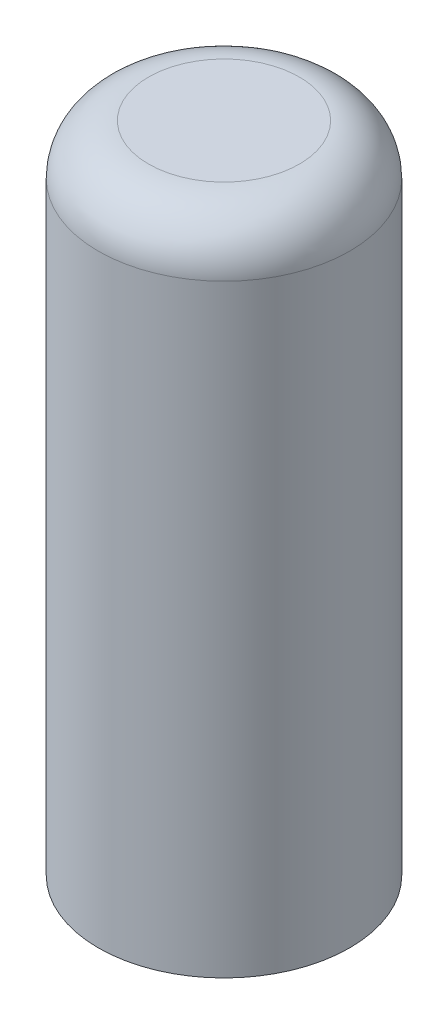
ISO-10303-21;
HEADER;
FILE_DESCRIPTION(('STEP AP214'),'2;1');
FILE_NAME('part.step','',(''),(''),'','','');
FILE_SCHEMA(('AUTOMOTIVE_DESIGN { 1 0 10303 214 1 1 1 1 }'));
ENDSEC;
DATA;
#1=APPLICATION_CONTEXT('core data for automotive mechanical design processes');
#2=APPLICATION_PROTOCOL_DEFINITION('international standard','automotive_design',2000,#1);
#3=PRODUCT_CONTEXT('',#1,'mechanical');
#4=PRODUCT('Part','Part','',(#3));
#5=PRODUCT_RELATED_PRODUCT_CATEGORY('part','',(#4));
#6=PRODUCT_DEFINITION_FORMATION('','',#4);
#7=PRODUCT_DEFINITION_CONTEXT('part definition',#1,'design');
#8=PRODUCT_DEFINITION('design','',#6,#7);
#9=PRODUCT_DEFINITION_SHAPE('','',#8);
#10=(LENGTH_UNIT() NAMED_UNIT(*) SI_UNIT(.MILLI.,.METRE.));
#11=(NAMED_UNIT(*) PLANE_ANGLE_UNIT() SI_UNIT($,.RADIAN.));
#12=(NAMED_UNIT(*) SI_UNIT($,.STERADIAN.) SOLID_ANGLE_UNIT());
#13=UNCERTAINTY_MEASURE_WITH_UNIT(LENGTH_MEASURE(1.E-05),#10,'distance_accuracy_value','');
#14=(GEOMETRIC_REPRESENTATION_CONTEXT(3) GLOBAL_UNCERTAINTY_ASSIGNED_CONTEXT((#13)) GLOBAL_UNIT_ASSIGNED_CONTEXT((#10,
#11,#12)) REPRESENTATION_CONTEXT('',''));
#15=CARTESIAN_POINT('',(0.,0.,0.));
#16=DIRECTION('',(0.,0.,1.));
#17=DIRECTION('',(1.,0.,0.));
#18=AXIS2_PLACEMENT_3D('',#15,#16,#17);
#19=CARTESIAN_POINT('',(0.575,6.5,-0.6));
#20=DIRECTION('',(-1.,0.,0.));
#21=DIRECTION('',(0.,0.,1.));
#22=AXIS2_PLACEMENT_3D('',#19,#20,#21);
#23=PLANE('',#22);
#24=DIRECTION('',(0.,-1.,0.));
#25=VECTOR('',#24,1.);
#26=CARTESIAN_POINT('',(0.575,6.5,0.6));
#27=LINE('',#26,#25);
#28=CARTESIAN_POINT('',(0.575,5.5,0.6));
#29=VERTEX_POINT('',#28);
#30=CARTESIAN_POINT('',(0.575,-6.5,0.6));
#31=VERTEX_POINT('',#30);
#32=EDGE_CURVE('E63',#29,#31,#27,.T.);
#33=ORIENTED_EDGE('',*,*,#32,.F.);
#34=DIRECTION('',(0.,0.,-1.));
#35=VECTOR('',#34,1.);
#36=CARTESIAN_POINT('',(0.575,5.5,0.6));
#37=LINE('',#36,#35);
#38=CARTESIAN_POINT('',(0.575,5.5,-0.6));
#39=VERTEX_POINT('',#38);
#40=EDGE_CURVE('E56',#29,#39,#37,.T.);
#41=ORIENTED_EDGE('',*,*,#40,.T.);
#42=DIRECTION('',(0.,-1.,0.));
#43=VECTOR('',#42,1.);
#44=CARTESIAN_POINT('',(0.575,6.5,-0.6));
#45=LINE('',#44,#43);
#46=CARTESIAN_POINT('',(0.575,-6.5,-0.6));
#47=VERTEX_POINT('',#46);
#48=EDGE_CURVE('E90',#39,#47,#45,.T.);
#49=ORIENTED_EDGE('',*,*,#48,.T.);
#50=DIRECTION('',(0.,0.,-1.));
#51=VECTOR('',#50,1.);
#52=CARTESIAN_POINT('',(0.575,-6.5,-0.6));
#53=LINE('',#52,#51);
#54=EDGE_CURVE('E141',#31,#47,#53,.T.);
#55=ORIENTED_EDGE('',*,*,#54,.F.);
#56=EDGE_LOOP('',(#33,#41,#49,#55));
#57=FACE_BOUND('',#56,.T.);
#58=ADVANCED_FACE('F41',(#57),#23,.T.);
#59=CARTESIAN_POINT('',(-0.575,6.5,-0.6));
#60=DIRECTION('',(0.,0.,1.));
#61=DIRECTION('',(1.,0.,0.));
#62=AXIS2_PLACEMENT_3D('',#59,#60,#61);
#63=PLANE('',#62);
#64=ORIENTED_EDGE('',*,*,#48,.F.);
#65=DIRECTION('',(-1.,0.,0.));
#66=VECTOR('',#65,1.);
#67=CARTESIAN_POINT('',(0.575,5.5,-0.6));
#68=LINE('',#67,#66);
#69=CARTESIAN_POINT('',(-0.575,5.5,-0.6));
#70=VERTEX_POINT('',#69);
#71=EDGE_CURVE('E81',#39,#70,#68,.T.);
#72=ORIENTED_EDGE('',*,*,#71,.T.);
#73=DIRECTION('',(0.,-1.,0.));
#74=VECTOR('',#73,1.);
#75=CARTESIAN_POINT('',(-0.575,6.5,-0.6));
#76=LINE('',#75,#74);
#77=CARTESIAN_POINT('',(-0.575,-6.5,-0.6));
#78=VERTEX_POINT('',#77);
#79=EDGE_CURVE('E99',#70,#78,#76,.T.);
#80=ORIENTED_EDGE('',*,*,#79,.T.);
#81=DIRECTION('',(-1.,0.,0.));
#82=VECTOR('',#81,1.);
#83=CARTESIAN_POINT('',(-0.575,-6.5,-0.6));
#84=LINE('',#83,#82);
#85=EDGE_CURVE('E96',#47,#78,#84,.T.);
#86=ORIENTED_EDGE('',*,*,#85,.F.);
#87=EDGE_LOOP('',(#64,#72,#80,#86));
#88=FACE_BOUND('',#87,.T.);
#89=ADVANCED_FACE('F94',(#88),#63,.T.);
#90=CARTESIAN_POINT('',(-0.575,6.5,-0.6));
#91=DIRECTION('',(1.,0.,0.));
#92=DIRECTION('',(0.,0.,-1.));
#93=AXIS2_PLACEMENT_3D('',#90,#91,#92);
#94=PLANE('',#93);
#95=ORIENTED_EDGE('',*,*,#79,.F.);
#96=DIRECTION('',(0.,0.,1.));
#97=VECTOR('',#96,1.);
#98=CARTESIAN_POINT('',(-0.575,5.5,-0.6));
#99=LINE('',#98,#97);
#100=CARTESIAN_POINT('',(-0.575,5.5,0.6));
#101=VERTEX_POINT('',#100);
#102=EDGE_CURVE('E84',#70,#101,#99,.T.);
#103=ORIENTED_EDGE('',*,*,#102,.T.);
#104=DIRECTION('',(0.,-1.,0.));
#105=VECTOR('',#104,1.);
#106=CARTESIAN_POINT('',(-0.575,6.5,0.6));
#107=LINE('',#106,#105);
#108=CARTESIAN_POINT('',(-0.575,-6.5,0.6));
#109=VERTEX_POINT('',#108);
#110=EDGE_CURVE('E103',#101,#109,#107,.T.);
#111=ORIENTED_EDGE('',*,*,#110,.T.);
#112=DIRECTION('',(0.,0.,1.));
#113=VECTOR('',#112,1.);
#114=CARTESIAN_POINT('',(-0.575,-6.5,-0.6));
#115=LINE('',#114,#113);
#116=EDGE_CURVE('E145',#78,#109,#115,.T.);
#117=ORIENTED_EDGE('',*,*,#116,.F.);
#118=EDGE_LOOP('',(#95,#103,#111,#117));
#119=FACE_BOUND('',#118,.T.);
#120=ADVANCED_FACE('F127',(#119),#94,.T.);
#121=CARTESIAN_POINT('',(-0.575,6.5,0.6));
#122=DIRECTION('',(0.,0.,-1.));
#123=DIRECTION('',(-1.,0.,0.));
#124=AXIS2_PLACEMENT_3D('',#121,#122,#123);
#125=PLANE('',#124);
#126=ORIENTED_EDGE('',*,*,#110,.F.);
#127=DIRECTION('',(1.,0.,0.));
#128=VECTOR('',#127,1.);
#129=CARTESIAN_POINT('',(-0.575,5.5,0.6));
#130=LINE('',#129,#128);
#131=EDGE_CURVE('E92',#101,#29,#130,.T.);
#132=ORIENTED_EDGE('',*,*,#131,.T.);
#133=ORIENTED_EDGE('',*,*,#32,.T.);
#134=DIRECTION('',(1.,0.,0.));
#135=VECTOR('',#134,1.);
#136=CARTESIAN_POINT('',(-0.575,-6.5,0.6));
#137=LINE('',#136,#135);
#138=EDGE_CURVE('E143',#109,#31,#137,.T.);
#139=ORIENTED_EDGE('',*,*,#138,.F.);
#140=EDGE_LOOP('',(#126,#132,#133,#139));
#141=FACE_BOUND('',#140,.T.);
#142=ADVANCED_FACE('F133',(#141),#125,.T.);
#143=CARTESIAN_POINT('',(0.,6.5,0.));
#144=DIRECTION('',(0.,1.,0.));
#145=DIRECTION('',(0.,0.,1.));
#146=AXIS2_PLACEMENT_3D('',#143,#144,#145);
#147=PLANE('',#146);
#148=CARTESIAN_POINT('',(0.,6.5,0.));
#149=DIRECTION('',(0.,1.,0.));
#150=DIRECTION('',(0.,0.,1.));
#151=AXIS2_PLACEMENT_3D('',#148,#149,#150);
#152=CIRCLE('',#151,1.5);
#153=CARTESIAN_POINT('',(0.,6.5,1.5));
#154=VERTEX_POINT('',#153);
#155=EDGE_CURVE('E49',#154,#154,#152,.T.);
#156=ORIENTED_EDGE('',*,*,#155,.T.);
#157=EDGE_LOOP('',(#156));
#158=FACE_BOUND('',#157,.T.);
#159=ADVANCED_FACE('F109',(#158),#147,.T.);
#160=CARTESIAN_POINT('',(0.,-6.5,0.));
#161=DIRECTION('',(0.,1.,0.));
#162=DIRECTION('',(0.,0.,1.));
#163=AXIS2_PLACEMENT_3D('',#160,#161,#162);
#164=PLANE('',#163);
#165=CARTESIAN_POINT('',(0.,-6.5,0.));
#166=DIRECTION('',(0.,1.,0.));
#167=DIRECTION('',(0.,0.,1.));
#168=AXIS2_PLACEMENT_3D('',#165,#166,#167);
#169=CIRCLE('',#168,2.5);
#170=CARTESIAN_POINT('',(0.,-6.5,2.5));
#171=VERTEX_POINT('',#170);
#172=EDGE_CURVE('E98',#171,#171,#169,.T.);
#173=ORIENTED_EDGE('',*,*,#172,.F.);
#174=EDGE_LOOP('',(#173));
#175=FACE_BOUND('',#174,.T.);
#176=ORIENTED_EDGE('',*,*,#54,.T.);
#177=ORIENTED_EDGE('',*,*,#85,.T.);
#178=ORIENTED_EDGE('',*,*,#116,.T.);
#179=ORIENTED_EDGE('',*,*,#138,.T.);
#180=EDGE_LOOP('',(#176,#177,#178,#179));
#181=FACE_BOUND('',#180,.T.);
#182=ADVANCED_FACE('F120',(#175,#181),#164,.F.);
#183=CARTESIAN_POINT('',(0.,6.5,0.));
#184=DIRECTION('',(0.,-1.,0.));
#185=DIRECTION('',(0.,0.,-1.));
#186=AXIS2_PLACEMENT_3D('',#183,#184,#185);
#187=CYLINDRICAL_SURFACE('',#186,2.5);
#188=CARTESIAN_POINT('',(0.,5.5,0.));
#189=DIRECTION('',(0.,1.,0.));
#190=DIRECTION('',(0.,0.,1.));
#191=AXIS2_PLACEMENT_3D('',#188,#189,#190);
#192=CIRCLE('',#191,2.5);
#193=CARTESIAN_POINT('',(0.,5.5,2.5));
#194=VERTEX_POINT('',#193);
#195=EDGE_CURVE('E11',#194,#194,#192,.F.);
#196=ORIENTED_EDGE('',*,*,#195,.T.);
#197=EDGE_LOOP('',(#196));
#198=FACE_BOUND('',#197,.T.);
#199=ORIENTED_EDGE('',*,*,#172,.T.);
#200=EDGE_LOOP('',(#199));
#201=FACE_BOUND('',#200,.T.);
#202=ADVANCED_FACE('F112',(#198,#201),#187,.T.);
#203=CARTESIAN_POINT('',(0.,5.5,0.));
#204=DIRECTION('',(0.,1.,0.));
#205=DIRECTION('',(0.,0.,1.));
#206=AXIS2_PLACEMENT_3D('',#203,#204,#205);
#207=TOROIDAL_SURFACE('',#206,1.5,1.);
#208=ORIENTED_EDGE('',*,*,#195,.F.);
#209=EDGE_LOOP('',(#208));
#210=FACE_BOUND('',#209,.T.);
#211=ORIENTED_EDGE('',*,*,#155,.F.);
#212=EDGE_LOOP('',(#211));
#213=FACE_BOUND('',#212,.T.);
#214=ADVANCED_FACE('F43',(#210,#213),#207,.T.);
#215=CARTESIAN_POINT('',(0.,5.5,0.));
#216=DIRECTION('',(0.,1.,0.));
#217=DIRECTION('',(0.,0.,1.));
#218=AXIS2_PLACEMENT_3D('',#215,#216,#217);
#219=PLANE('',#218);
#220=ORIENTED_EDGE('',*,*,#131,.F.);
#221=ORIENTED_EDGE('',*,*,#102,.F.);
#222=ORIENTED_EDGE('',*,*,#71,.F.);
#223=ORIENTED_EDGE('',*,*,#40,.F.);
#224=EDGE_LOOP('',(#220,#221,#222,#223));
#225=FACE_BOUND('',#224,.T.);
#226=ADVANCED_FACE('F82',(#225),#219,.F.);
#227=CLOSED_SHELL('',(#58,#89,#120,#142,#159,#182,#202,#214,#226));
#228=MANIFOLD_SOLID_BREP('B2',#227);
#229=ADVANCED_BREP_SHAPE_REPRESENTATION('',(#18,#228),#14);
#230=SHAPE_DEFINITION_REPRESENTATION(#9,#229);
ENDSEC;
END-ISO-10303-21;
